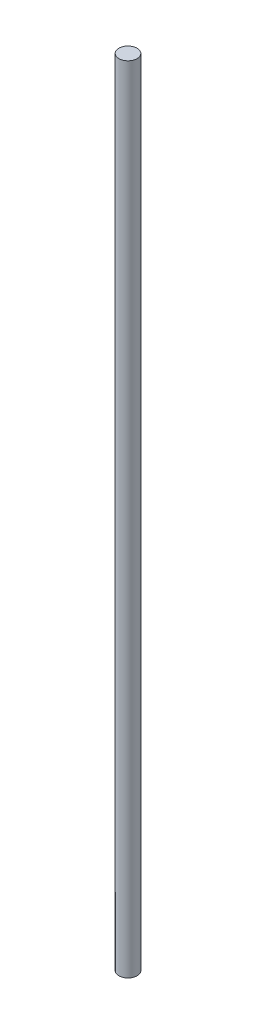
ISO-10303-21;
HEADER;
FILE_DESCRIPTION(('STEP AP214'),'2;1');
FILE_NAME('part.step','',(''),(''),'','','');
FILE_SCHEMA(('AUTOMOTIVE_DESIGN { 1 0 10303 214 1 1 1 1 }'));
ENDSEC;
DATA;
#1=APPLICATION_CONTEXT('core data for automotive mechanical design processes');
#2=APPLICATION_PROTOCOL_DEFINITION('international standard','automotive_design',2000,#1);
#3=PRODUCT_CONTEXT('',#1,'mechanical');
#4=PRODUCT('Part','Part','',(#3));
#5=PRODUCT_RELATED_PRODUCT_CATEGORY('part','',(#4));
#6=PRODUCT_DEFINITION_FORMATION('','',#4);
#7=PRODUCT_DEFINITION_CONTEXT('part definition',#1,'design');
#8=PRODUCT_DEFINITION('design','',#6,#7);
#9=PRODUCT_DEFINITION_SHAPE('','',#8);
#10=(LENGTH_UNIT() NAMED_UNIT(*) SI_UNIT(.MILLI.,.METRE.));
#11=(NAMED_UNIT(*) PLANE_ANGLE_UNIT() SI_UNIT($,.RADIAN.));
#12=(NAMED_UNIT(*) SI_UNIT($,.STERADIAN.) SOLID_ANGLE_UNIT());
#13=UNCERTAINTY_MEASURE_WITH_UNIT(LENGTH_MEASURE(1.E-05),#10,'distance_accuracy_value','');
#14=(GEOMETRIC_REPRESENTATION_CONTEXT(3) GLOBAL_UNCERTAINTY_ASSIGNED_CONTEXT((#13)) GLOBAL_UNIT_ASSIGNED_CONTEXT((#10,
#11,#12)) REPRESENTATION_CONTEXT('',''));
#15=CARTESIAN_POINT('',(0.,0.,0.));
#16=DIRECTION('',(0.,0.,1.));
#17=DIRECTION('',(1.,0.,0.));
#18=AXIS2_PLACEMENT_3D('',#15,#16,#17);
#19=CARTESIAN_POINT('',(0.,350.,0.));
#20=DIRECTION('',(0.,-1.,0.));
#21=DIRECTION('',(0.,0.,-1.));
#22=AXIS2_PLACEMENT_3D('',#19,#20,#21);
#23=CYLINDRICAL_SURFACE('',#22,4.);
#24=CARTESIAN_POINT('',(0.,350.,0.));
#25=DIRECTION('',(0.,1.,0.));
#26=DIRECTION('',(0.,0.,1.));
#27=AXIS2_PLACEMENT_3D('',#24,#25,#26);
#28=CIRCLE('',#27,4.);
#29=CARTESIAN_POINT('',(0.,350.,4.));
#30=VERTEX_POINT('',#29);
#31=EDGE_CURVE('E10',#30,#30,#28,.T.);
#32=ORIENTED_EDGE('',*,*,#31,.F.);
#33=EDGE_LOOP('',(#32));
#34=FACE_BOUND('',#33,.T.);
#35=CARTESIAN_POINT('',(0.,0.,0.));
#36=DIRECTION('',(0.,1.,0.));
#37=DIRECTION('',(0.,0.,1.));
#38=AXIS2_PLACEMENT_3D('',#35,#36,#37);
#39=CIRCLE('',#38,4.);
#40=CARTESIAN_POINT('',(0.,0.,4.));
#41=VERTEX_POINT('',#40);
#42=EDGE_CURVE('E34',#41,#41,#39,.T.);
#43=ORIENTED_EDGE('',*,*,#42,.T.);
#44=EDGE_LOOP('',(#43));
#45=FACE_BOUND('',#44,.T.);
#46=ADVANCED_FACE('F31',(#34,#45),#23,.T.);
#47=CARTESIAN_POINT('',(0.,350.,0.));
#48=DIRECTION('',(0.,1.,0.));
#49=DIRECTION('',(0.,0.,1.));
#50=AXIS2_PLACEMENT_3D('',#47,#48,#49);
#51=PLANE('',#50);
#52=ORIENTED_EDGE('',*,*,#31,.T.);
#53=EDGE_LOOP('',(#52));
#54=FACE_BOUND('',#53,.T.);
#55=ADVANCED_FACE('F46',(#54),#51,.T.);
#56=CARTESIAN_POINT('',(0.,0.,0.));
#57=DIRECTION('',(0.,1.,0.));
#58=DIRECTION('',(0.,0.,1.));
#59=AXIS2_PLACEMENT_3D('',#56,#57,#58);
#60=PLANE('',#59);
#61=ORIENTED_EDGE('',*,*,#42,.F.);
#62=EDGE_LOOP('',(#61));
#63=FACE_BOUND('',#62,.T.);
#64=ADVANCED_FACE('F44',(#63),#60,.F.);
#65=CLOSED_SHELL('',(#46,#55,#64));
#66=MANIFOLD_SOLID_BREP('B2',#65);
#67=ADVANCED_BREP_SHAPE_REPRESENTATION('',(#18,#66),#14);
#68=SHAPE_DEFINITION_REPRESENTATION(#9,#67);
ENDSEC;
END-ISO-10303-21;
